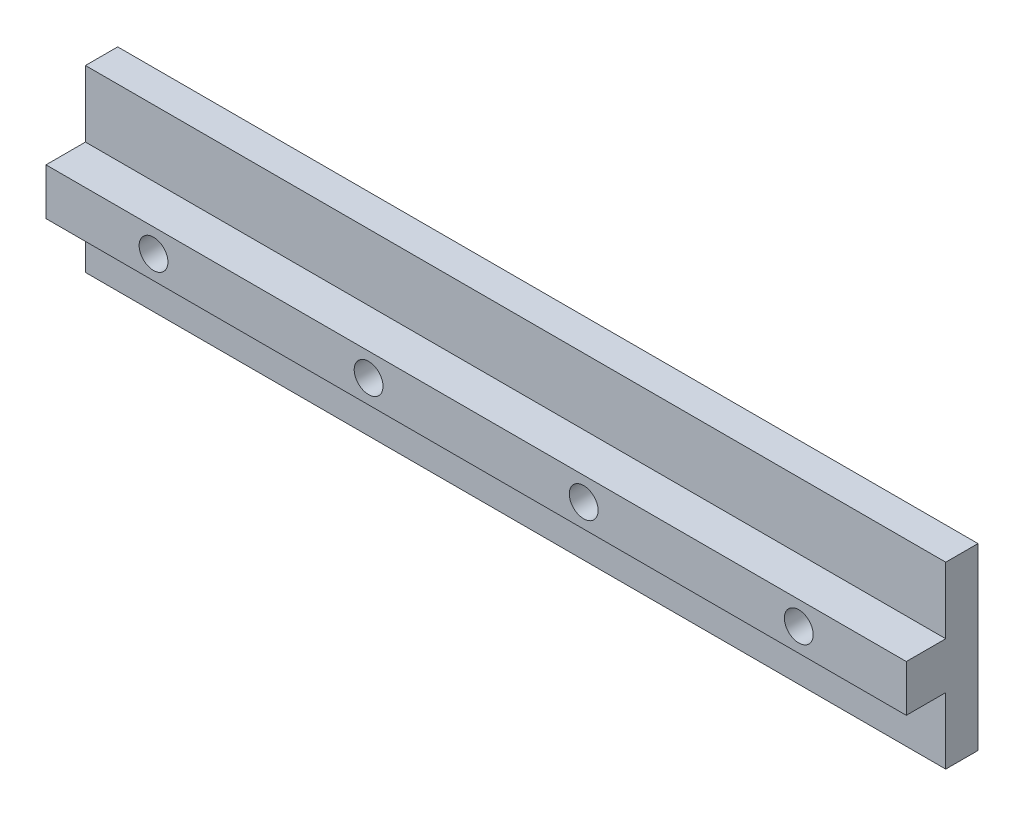
ISO-10303-21;
HEADER;
FILE_DESCRIPTION(('STEP AP214'),'2;1');
FILE_NAME('part.step','',(''),(''),'','','');
FILE_SCHEMA(('AUTOMOTIVE_DESIGN { 1 0 10303 214 1 1 1 1 }'));
ENDSEC;
DATA;
#1=APPLICATION_CONTEXT('core data for automotive mechanical design processes');
#2=APPLICATION_PROTOCOL_DEFINITION('international standard','automotive_design',2000,#1);
#3=PRODUCT_CONTEXT('',#1,'mechanical');
#4=PRODUCT('Part','Part','',(#3));
#5=PRODUCT_RELATED_PRODUCT_CATEGORY('part','',(#4));
#6=PRODUCT_DEFINITION_FORMATION('','',#4);
#7=PRODUCT_DEFINITION_CONTEXT('part definition',#1,'design');
#8=PRODUCT_DEFINITION('design','',#6,#7);
#9=PRODUCT_DEFINITION_SHAPE('','',#8);
#10=(LENGTH_UNIT() NAMED_UNIT(*) SI_UNIT(.MILLI.,.METRE.));
#11=(NAMED_UNIT(*) PLANE_ANGLE_UNIT() SI_UNIT($,.RADIAN.));
#12=(NAMED_UNIT(*) SI_UNIT($,.STERADIAN.) SOLID_ANGLE_UNIT());
#13=UNCERTAINTY_MEASURE_WITH_UNIT(LENGTH_MEASURE(1.E-05),#10,'distance_accuracy_value','');
#14=(GEOMETRIC_REPRESENTATION_CONTEXT(3) GLOBAL_UNCERTAINTY_ASSIGNED_CONTEXT((#13)) GLOBAL_UNIT_ASSIGNED_CONTEXT((#10,
#11,#12)) REPRESENTATION_CONTEXT('',''));
#15=CARTESIAN_POINT('',(0.,0.,0.));
#16=DIRECTION('',(0.,0.,1.));
#17=DIRECTION('',(1.,0.,0.));
#18=AXIS2_PLACEMENT_3D('',#15,#16,#17);
#19=CARTESIAN_POINT('',(-76.2,15.875,12.7));
#20=DIRECTION('',(0.,-1.,0.));
#21=DIRECTION('',(0.,0.,-1.));
#22=AXIS2_PLACEMENT_3D('',#19,#20,#21);
#23=PLANE('',#22);
#24=DIRECTION('',(-1.,0.,0.));
#25=VECTOR('',#24,1.);
#26=CARTESIAN_POINT('',(-76.2,15.875,5.715));
#27=LINE('',#26,#25);
#28=CARTESIAN_POINT('',(76.2,15.875,5.715));
#29=VERTEX_POINT('',#28);
#30=CARTESIAN_POINT('',(-76.2,15.875,5.715));
#31=VERTEX_POINT('',#30);
#32=EDGE_CURVE('E142',#29,#31,#27,.T.);
#33=ORIENTED_EDGE('',*,*,#32,.F.);
#34=DIRECTION('',(0.,0.,-1.));
#35=VECTOR('',#34,1.);
#36=CARTESIAN_POINT('',(76.2,15.875,12.7));
#37=LINE('',#36,#35);
#38=CARTESIAN_POINT('',(76.2,15.875,0.));
#39=VERTEX_POINT('',#38);
#40=EDGE_CURVE('E11',#29,#39,#37,.T.);
#41=ORIENTED_EDGE('',*,*,#40,.T.);
#42=DIRECTION('',(-1.,0.,0.));
#43=VECTOR('',#42,1.);
#44=CARTESIAN_POINT('',(-76.2,15.875,0.));
#45=LINE('',#44,#43);
#46=CARTESIAN_POINT('',(-76.2,15.875,0.));
#47=VERTEX_POINT('',#46);
#48=EDGE_CURVE('E131',#39,#47,#45,.T.);
#49=ORIENTED_EDGE('',*,*,#48,.T.);
#50=DIRECTION('',(0.,0.,-1.));
#51=VECTOR('',#50,1.);
#52=CARTESIAN_POINT('',(-76.2,15.875,12.7));
#53=LINE('',#52,#51);
#54=EDGE_CURVE('E41',#31,#47,#53,.T.);
#55=ORIENTED_EDGE('',*,*,#54,.F.);
#56=EDGE_LOOP('',(#33,#41,#49,#55));
#57=FACE_BOUND('',#56,.T.);
#58=ADVANCED_FACE('F33',(#57),#23,.F.);
#59=CARTESIAN_POINT('',(76.2,15.875,12.7));
#60=DIRECTION('',(-1.,0.,0.));
#61=DIRECTION('',(0.,0.,1.));
#62=AXIS2_PLACEMENT_3D('',#59,#60,#61);
#63=PLANE('',#62);
#64=DIRECTION('',(0.,1.,0.));
#65=VECTOR('',#64,1.);
#66=CARTESIAN_POINT('',(76.2,15.875,12.7));
#67=LINE('',#66,#65);
#68=CARTESIAN_POINT('',(76.2,-4.12750000000002,12.7));
#69=VERTEX_POINT('',#68);
#70=CARTESIAN_POINT('',(76.2,4.12750000000002,12.7));
#71=VERTEX_POINT('',#70);
#72=EDGE_CURVE('E129',#69,#71,#67,.T.);
#73=ORIENTED_EDGE('',*,*,#72,.F.);
#74=DIRECTION('',(0.,0.,1.));
#75=VECTOR('',#74,1.);
#76=CARTESIAN_POINT('',(76.2,-4.12750000000002,5.715));
#77=LINE('',#76,#75);
#78=CARTESIAN_POINT('',(76.2,-4.12750000000002,5.715));
#79=VERTEX_POINT('',#78);
#80=EDGE_CURVE('E48',#79,#69,#77,.T.);
#81=ORIENTED_EDGE('',*,*,#80,.F.);
#82=DIRECTION('',(0.,1.,0.));
#83=VECTOR('',#82,1.);
#84=CARTESIAN_POINT('',(76.2,-15.875,5.715));
#85=LINE('',#84,#83);
#86=CARTESIAN_POINT('',(76.2,-15.875,5.715));
#87=VERTEX_POINT('',#86);
#88=EDGE_CURVE('E117',#87,#79,#85,.T.);
#89=ORIENTED_EDGE('',*,*,#88,.F.);
#90=DIRECTION('',(0.,0.,-1.));
#91=VECTOR('',#90,1.);
#92=CARTESIAN_POINT('',(76.2,-15.875,12.7));
#93=LINE('',#92,#91);
#94=CARTESIAN_POINT('',(76.2,-15.875,0.));
#95=VERTEX_POINT('',#94);
#96=EDGE_CURVE('E116',#87,#95,#93,.T.);
#97=ORIENTED_EDGE('',*,*,#96,.T.);
#98=DIRECTION('',(0.,1.,0.));
#99=VECTOR('',#98,1.);
#100=CARTESIAN_POINT('',(76.2,15.875,0.));
#101=LINE('',#100,#99);
#102=EDGE_CURVE('E134',#95,#39,#101,.T.);
#103=ORIENTED_EDGE('',*,*,#102,.T.);
#104=ORIENTED_EDGE('',*,*,#40,.F.);
#105=DIRECTION('',(0.,1.,0.));
#106=VECTOR('',#105,1.);
#107=CARTESIAN_POINT('',(76.2,15.875,5.715));
#108=LINE('',#107,#106);
#109=CARTESIAN_POINT('',(76.2,4.12750000000002,5.715));
#110=VERTEX_POINT('',#109);
#111=EDGE_CURVE('E150',#110,#29,#108,.T.);
#112=ORIENTED_EDGE('',*,*,#111,.F.);
#113=DIRECTION('',(0.,0.,1.));
#114=VECTOR('',#113,1.);
#115=CARTESIAN_POINT('',(76.2,4.12750000000002,5.715));
#116=LINE('',#115,#114);
#117=EDGE_CURVE('E137',#110,#71,#116,.T.);
#118=ORIENTED_EDGE('',*,*,#117,.T.);
#119=EDGE_LOOP('',(#73,#81,#89,#97,#103,#104,#112,#118));
#120=FACE_BOUND('',#119,.T.);
#121=ADVANCED_FACE('F35',(#120),#63,.F.);
#122=CARTESIAN_POINT('',(-76.2,15.875,12.7));
#123=DIRECTION('',(1.,0.,0.));
#124=DIRECTION('',(0.,0.,-1.));
#125=AXIS2_PLACEMENT_3D('',#122,#123,#124);
#126=PLANE('',#125);
#127=DIRECTION('',(0.,-1.,0.));
#128=VECTOR('',#127,1.);
#129=CARTESIAN_POINT('',(-76.2,-15.875,5.715));
#130=LINE('',#129,#128);
#131=CARTESIAN_POINT('',(-76.2,-4.1275,5.715));
#132=VERTEX_POINT('',#131);
#133=CARTESIAN_POINT('',(-76.2,-15.875,5.715));
#134=VERTEX_POINT('',#133);
#135=EDGE_CURVE('E99',#132,#134,#130,.T.);
#136=ORIENTED_EDGE('',*,*,#135,.F.);
#137=DIRECTION('',(0.,0.,1.));
#138=VECTOR('',#137,1.);
#139=CARTESIAN_POINT('',(-76.2,-4.1275,5.715));
#140=LINE('',#139,#138);
#141=CARTESIAN_POINT('',(-76.2,-4.1275,12.7));
#142=VERTEX_POINT('',#141);
#143=EDGE_CURVE('E148',#132,#142,#140,.T.);
#144=ORIENTED_EDGE('',*,*,#143,.T.);
#145=DIRECTION('',(0.,-1.,0.));
#146=VECTOR('',#145,1.);
#147=CARTESIAN_POINT('',(-76.2,15.875,12.7));
#148=LINE('',#147,#146);
#149=CARTESIAN_POINT('',(-76.2,4.12750000000001,12.7));
#150=VERTEX_POINT('',#149);
#151=EDGE_CURVE('E124',#150,#142,#148,.T.);
#152=ORIENTED_EDGE('',*,*,#151,.F.);
#153=DIRECTION('',(0.,0.,1.));
#154=VECTOR('',#153,1.);
#155=CARTESIAN_POINT('',(-76.2,4.1275,5.715));
#156=LINE('',#155,#154);
#157=CARTESIAN_POINT('',(-76.2,4.1275,5.715));
#158=VERTEX_POINT('',#157);
#159=EDGE_CURVE('E56',#158,#150,#156,.T.);
#160=ORIENTED_EDGE('',*,*,#159,.F.);
#161=DIRECTION('',(0.,-1.,0.));
#162=VECTOR('',#161,1.);
#163=CARTESIAN_POINT('',(-76.2,15.875,5.715));
#164=LINE('',#163,#162);
#165=EDGE_CURVE('E147',#31,#158,#164,.T.);
#166=ORIENTED_EDGE('',*,*,#165,.F.);
#167=ORIENTED_EDGE('',*,*,#54,.T.);
#168=DIRECTION('',(0.,-1.,0.));
#169=VECTOR('',#168,1.);
#170=CARTESIAN_POINT('',(-76.2,15.875,0.));
#171=LINE('',#170,#169);
#172=CARTESIAN_POINT('',(-76.2,-15.875,0.));
#173=VERTEX_POINT('',#172);
#174=EDGE_CURVE('E121',#47,#173,#171,.T.);
#175=ORIENTED_EDGE('',*,*,#174,.T.);
#176=DIRECTION('',(0.,0.,-1.));
#177=VECTOR('',#176,1.);
#178=CARTESIAN_POINT('',(-76.2,-15.875,12.7));
#179=LINE('',#178,#177);
#180=EDGE_CURVE('E114',#134,#173,#179,.T.);
#181=ORIENTED_EDGE('',*,*,#180,.F.);
#182=EDGE_LOOP('',(#136,#144,#152,#160,#166,#167,#175,#181));
#183=FACE_BOUND('',#182,.T.);
#184=ADVANCED_FACE('F119',(#183),#126,.F.);
#185=CARTESIAN_POINT('',(-76.2,-15.875,12.7));
#186=DIRECTION('',(0.,1.,0.));
#187=DIRECTION('',(0.,0.,1.));
#188=AXIS2_PLACEMENT_3D('',#185,#186,#187);
#189=PLANE('',#188);
#190=ORIENTED_EDGE('',*,*,#96,.F.);
#191=DIRECTION('',(1.,0.,0.));
#192=VECTOR('',#191,1.);
#193=CARTESIAN_POINT('',(-76.2,-15.875,5.715));
#194=LINE('',#193,#192);
#195=EDGE_CURVE('E102',#134,#87,#194,.T.);
#196=ORIENTED_EDGE('',*,*,#195,.F.);
#197=ORIENTED_EDGE('',*,*,#180,.T.);
#198=DIRECTION('',(1.,0.,0.));
#199=VECTOR('',#198,1.);
#200=CARTESIAN_POINT('',(-76.2,-15.875,0.));
#201=LINE('',#200,#199);
#202=EDGE_CURVE('E127',#173,#95,#201,.T.);
#203=ORIENTED_EDGE('',*,*,#202,.T.);
#204=EDGE_LOOP('',(#190,#196,#197,#203));
#205=FACE_BOUND('',#204,.T.);
#206=ADVANCED_FACE('F112',(#205),#189,.F.);
#207=CARTESIAN_POINT('',(0.,0.,12.7));
#208=DIRECTION('',(0.,0.,1.));
#209=DIRECTION('',(1.,0.,0.));
#210=AXIS2_PLACEMENT_3D('',#207,#208,#209);
#211=PLANE('',#210);
#212=CARTESIAN_POINT('',(-57.15,0.,12.7));
#213=DIRECTION('',(0.,0.,1.));
#214=DIRECTION('',(1.,0.,0.));
#215=AXIS2_PLACEMENT_3D('',#212,#213,#214);
#216=CIRCLE('',#215,2.55269999999999);
#217=CARTESIAN_POINT('',(-54.5973,0.,12.7));
#218=VERTEX_POINT('',#217);
#219=EDGE_CURVE('E183',#218,#218,#216,.T.);
#220=ORIENTED_EDGE('',*,*,#219,.F.);
#221=EDGE_LOOP('',(#220));
#222=FACE_BOUND('',#221,.T.);
#223=CARTESIAN_POINT('',(-19.05,0.,12.7));
#224=DIRECTION('',(0.,0.,1.));
#225=DIRECTION('',(1.,0.,0.));
#226=AXIS2_PLACEMENT_3D('',#223,#224,#225);
#227=CIRCLE('',#226,2.55269999999999);
#228=CARTESIAN_POINT('',(-16.4973,0.,12.7));
#229=VERTEX_POINT('',#228);
#230=EDGE_CURVE('E177',#229,#229,#227,.T.);
#231=ORIENTED_EDGE('',*,*,#230,.F.);
#232=EDGE_LOOP('',(#231));
#233=FACE_BOUND('',#232,.T.);
#234=CARTESIAN_POINT('',(19.05,0.,12.7));
#235=DIRECTION('',(0.,0.,1.));
#236=DIRECTION('',(1.,0.,0.));
#237=AXIS2_PLACEMENT_3D('',#234,#235,#236);
#238=CIRCLE('',#237,2.55269999999999);
#239=CARTESIAN_POINT('',(21.6027,0.,12.7));
#240=VERTEX_POINT('',#239);
#241=EDGE_CURVE('E171',#240,#240,#238,.T.);
#242=ORIENTED_EDGE('',*,*,#241,.F.);
#243=EDGE_LOOP('',(#242));
#244=FACE_BOUND('',#243,.T.);
#245=CARTESIAN_POINT('',(57.15,0.,12.7));
#246=DIRECTION('',(0.,0.,1.));
#247=DIRECTION('',(1.,0.,0.));
#248=AXIS2_PLACEMENT_3D('',#245,#246,#247);
#249=CIRCLE('',#248,2.55269999999999);
#250=CARTESIAN_POINT('',(59.7027,0.,12.7));
#251=VERTEX_POINT('',#250);
#252=EDGE_CURVE('E165',#251,#251,#249,.T.);
#253=ORIENTED_EDGE('',*,*,#252,.F.);
#254=EDGE_LOOP('',(#253));
#255=FACE_BOUND('',#254,.T.);
#256=DIRECTION('',(-1.,0.,0.));
#257=VECTOR('',#256,1.);
#258=CARTESIAN_POINT('',(-76.2,-4.1275,12.7));
#259=LINE('',#258,#257);
#260=EDGE_CURVE('E108',#69,#142,#259,.T.);
#261=ORIENTED_EDGE('',*,*,#260,.F.);
#262=ORIENTED_EDGE('',*,*,#72,.T.);
#263=DIRECTION('',(1.,0.,0.));
#264=VECTOR('',#263,1.);
#265=CARTESIAN_POINT('',(-76.2,4.1275,12.7));
#266=LINE('',#265,#264);
#267=EDGE_CURVE('E145',#150,#71,#266,.T.);
#268=ORIENTED_EDGE('',*,*,#267,.F.);
#269=ORIENTED_EDGE('',*,*,#151,.T.);
#270=EDGE_LOOP('',(#261,#262,#268,#269));
#271=FACE_BOUND('',#270,.T.);
#272=ADVANCED_FACE('F189',(#222,#233,#244,#255,#271),#211,.T.);
#273=CARTESIAN_POINT('',(0.,0.,0.));
#274=DIRECTION('',(0.,0.,1.));
#275=DIRECTION('',(1.,0.,0.));
#276=AXIS2_PLACEMENT_3D('',#273,#274,#275);
#277=PLANE('',#276);
#278=CARTESIAN_POINT('',(-57.15,0.,0.));
#279=DIRECTION('',(0.,0.,1.));
#280=DIRECTION('',(1.,0.,0.));
#281=AXIS2_PLACEMENT_3D('',#278,#279,#280);
#282=CIRCLE('',#281,2.55269999999999);
#283=CARTESIAN_POINT('',(-54.5973,0.,0.));
#284=VERTEX_POINT('',#283);
#285=EDGE_CURVE('E180',#284,#284,#282,.T.);
#286=ORIENTED_EDGE('',*,*,#285,.T.);
#287=EDGE_LOOP('',(#286));
#288=FACE_BOUND('',#287,.T.);
#289=CARTESIAN_POINT('',(-19.05,0.,0.));
#290=DIRECTION('',(0.,0.,1.));
#291=DIRECTION('',(1.,0.,0.));
#292=AXIS2_PLACEMENT_3D('',#289,#290,#291);
#293=CIRCLE('',#292,2.55269999999999);
#294=CARTESIAN_POINT('',(-16.4973,0.,0.));
#295=VERTEX_POINT('',#294);
#296=EDGE_CURVE('E174',#295,#295,#293,.T.);
#297=ORIENTED_EDGE('',*,*,#296,.T.);
#298=EDGE_LOOP('',(#297));
#299=FACE_BOUND('',#298,.T.);
#300=CARTESIAN_POINT('',(19.05,0.,0.));
#301=DIRECTION('',(0.,0.,1.));
#302=DIRECTION('',(1.,0.,0.));
#303=AXIS2_PLACEMENT_3D('',#300,#301,#302);
#304=CIRCLE('',#303,2.55269999999999);
#305=CARTESIAN_POINT('',(21.6027,0.,0.));
#306=VERTEX_POINT('',#305);
#307=EDGE_CURVE('E168',#306,#306,#304,.T.);
#308=ORIENTED_EDGE('',*,*,#307,.T.);
#309=EDGE_LOOP('',(#308));
#310=FACE_BOUND('',#309,.T.);
#311=CARTESIAN_POINT('',(57.15,0.,0.));
#312=DIRECTION('',(0.,0.,1.));
#313=DIRECTION('',(1.,0.,0.));
#314=AXIS2_PLACEMENT_3D('',#311,#312,#313);
#315=CIRCLE('',#314,2.55269999999999);
#316=CARTESIAN_POINT('',(59.7027,0.,0.));
#317=VERTEX_POINT('',#316);
#318=EDGE_CURVE('E160',#317,#317,#315,.T.);
#319=ORIENTED_EDGE('',*,*,#318,.T.);
#320=EDGE_LOOP('',(#319));
#321=FACE_BOUND('',#320,.T.);
#322=ORIENTED_EDGE('',*,*,#102,.F.);
#323=ORIENTED_EDGE('',*,*,#202,.F.);
#324=ORIENTED_EDGE('',*,*,#174,.F.);
#325=ORIENTED_EDGE('',*,*,#48,.F.);
#326=EDGE_LOOP('',(#322,#323,#324,#325));
#327=FACE_BOUND('',#326,.T.);
#328=ADVANCED_FACE('F192',(#288,#299,#310,#321,#327),#277,.F.);
#329=CARTESIAN_POINT('',(-76.2,4.1275,5.715));
#330=DIRECTION('',(0.,-1.,0.));
#331=DIRECTION('',(1.,0.,0.));
#332=AXIS2_PLACEMENT_3D('',#329,#330,#331);
#333=PLANE('',#332);
#334=ORIENTED_EDGE('',*,*,#267,.T.);
#335=ORIENTED_EDGE('',*,*,#117,.F.);
#336=DIRECTION('',(1.,0.,0.));
#337=VECTOR('',#336,1.);
#338=CARTESIAN_POINT('',(-76.2,4.1275,5.715));
#339=LINE('',#338,#337);
#340=EDGE_CURVE('E152',#158,#110,#339,.T.);
#341=ORIENTED_EDGE('',*,*,#340,.F.);
#342=ORIENTED_EDGE('',*,*,#159,.T.);
#343=EDGE_LOOP('',(#334,#335,#341,#342));
#344=FACE_BOUND('',#343,.T.);
#345=ADVANCED_FACE('F205',(#344),#333,.F.);
#346=CARTESIAN_POINT('',(0.,0.,5.715));
#347=DIRECTION('',(0.,0.,1.));
#348=DIRECTION('',(1.,0.,0.));
#349=AXIS2_PLACEMENT_3D('',#346,#347,#348);
#350=PLANE('',#349);
#351=ORIENTED_EDGE('',*,*,#165,.T.);
#352=ORIENTED_EDGE('',*,*,#340,.T.);
#353=ORIENTED_EDGE('',*,*,#111,.T.);
#354=ORIENTED_EDGE('',*,*,#32,.T.);
#355=EDGE_LOOP('',(#351,#352,#353,#354));
#356=FACE_BOUND('',#355,.T.);
#357=ADVANCED_FACE('F207',(#356),#350,.T.);
#358=CARTESIAN_POINT('',(-76.2,-4.1275,5.715));
#359=DIRECTION('',(0.,1.,0.));
#360=DIRECTION('',(-1.,0.,0.));
#361=AXIS2_PLACEMENT_3D('',#358,#359,#360);
#362=PLANE('',#361);
#363=ORIENTED_EDGE('',*,*,#260,.T.);
#364=ORIENTED_EDGE('',*,*,#143,.F.);
#365=DIRECTION('',(-1.,0.,0.));
#366=VECTOR('',#365,1.);
#367=CARTESIAN_POINT('',(-76.2,-4.1275,5.715));
#368=LINE('',#367,#366);
#369=EDGE_CURVE('E104',#79,#132,#368,.T.);
#370=ORIENTED_EDGE('',*,*,#369,.F.);
#371=ORIENTED_EDGE('',*,*,#80,.T.);
#372=EDGE_LOOP('',(#363,#364,#370,#371));
#373=FACE_BOUND('',#372,.T.);
#374=ADVANCED_FACE('F211',(#373),#362,.F.);
#375=CARTESIAN_POINT('',(0.,0.,5.715));
#376=DIRECTION('',(0.,0.,-1.));
#377=DIRECTION('',(-1.,0.,0.));
#378=AXIS2_PLACEMENT_3D('',#375,#376,#377);
#379=PLANE('',#378);
#380=ORIENTED_EDGE('',*,*,#135,.T.);
#381=ORIENTED_EDGE('',*,*,#195,.T.);
#382=ORIENTED_EDGE('',*,*,#88,.T.);
#383=ORIENTED_EDGE('',*,*,#369,.T.);
#384=EDGE_LOOP('',(#380,#381,#382,#383));
#385=FACE_BOUND('',#384,.T.);
#386=ADVANCED_FACE('F101',(#385),#379,.F.);
#387=CARTESIAN_POINT('',(57.15,0.,12.7));
#388=DIRECTION('',(0.,0.,1.));
#389=DIRECTION('',(1.,0.,0.));
#390=AXIS2_PLACEMENT_3D('',#387,#388,#389);
#391=CYLINDRICAL_SURFACE('',#390,2.55269999999999);
#392=ORIENTED_EDGE('',*,*,#318,.F.);
#393=EDGE_LOOP('',(#392));
#394=FACE_BOUND('',#393,.T.);
#395=ORIENTED_EDGE('',*,*,#252,.T.);
#396=EDGE_LOOP('',(#395));
#397=FACE_BOUND('',#396,.T.);
#398=ADVANCED_FACE('F218',(#394,#397),#391,.F.);
#399=CARTESIAN_POINT('',(19.05,0.,12.7));
#400=DIRECTION('',(0.,0.,1.));
#401=DIRECTION('',(1.,0.,0.));
#402=AXIS2_PLACEMENT_3D('',#399,#400,#401);
#403=CYLINDRICAL_SURFACE('',#402,2.55269999999999);
#404=ORIENTED_EDGE('',*,*,#307,.F.);
#405=EDGE_LOOP('',(#404));
#406=FACE_BOUND('',#405,.T.);
#407=ORIENTED_EDGE('',*,*,#241,.T.);
#408=EDGE_LOOP('',(#407));
#409=FACE_BOUND('',#408,.T.);
#410=ADVANCED_FACE('F275',(#406,#409),#403,.F.);
#411=CARTESIAN_POINT('',(-19.05,0.,12.7));
#412=DIRECTION('',(0.,0.,1.));
#413=DIRECTION('',(1.,0.,0.));
#414=AXIS2_PLACEMENT_3D('',#411,#412,#413);
#415=CYLINDRICAL_SURFACE('',#414,2.55269999999999);
#416=ORIENTED_EDGE('',*,*,#296,.F.);
#417=EDGE_LOOP('',(#416));
#418=FACE_BOUND('',#417,.T.);
#419=ORIENTED_EDGE('',*,*,#230,.T.);
#420=EDGE_LOOP('',(#419));
#421=FACE_BOUND('',#420,.T.);
#422=ADVANCED_FACE('F285',(#418,#421),#415,.F.);
#423=CARTESIAN_POINT('',(-57.15,0.,12.7));
#424=DIRECTION('',(0.,0.,1.));
#425=DIRECTION('',(1.,0.,0.));
#426=AXIS2_PLACEMENT_3D('',#423,#424,#425);
#427=CYLINDRICAL_SURFACE('',#426,2.55269999999999);
#428=ORIENTED_EDGE('',*,*,#285,.F.);
#429=EDGE_LOOP('',(#428));
#430=FACE_BOUND('',#429,.T.);
#431=ORIENTED_EDGE('',*,*,#219,.T.);
#432=EDGE_LOOP('',(#431));
#433=FACE_BOUND('',#432,.T.);
#434=ADVANCED_FACE('F187',(#430,#433),#427,.F.);
#435=CLOSED_SHELL('',(#58,#121,#184,#206,#272,#328,#345,#357,#374,#386,#398,#410,#422,#434));
#436=MANIFOLD_SOLID_BREP('B2',#435);
#437=ADVANCED_BREP_SHAPE_REPRESENTATION('',(#18,#436),#14);
#438=SHAPE_DEFINITION_REPRESENTATION(#9,#437);
ENDSEC;
END-ISO-10303-21;
